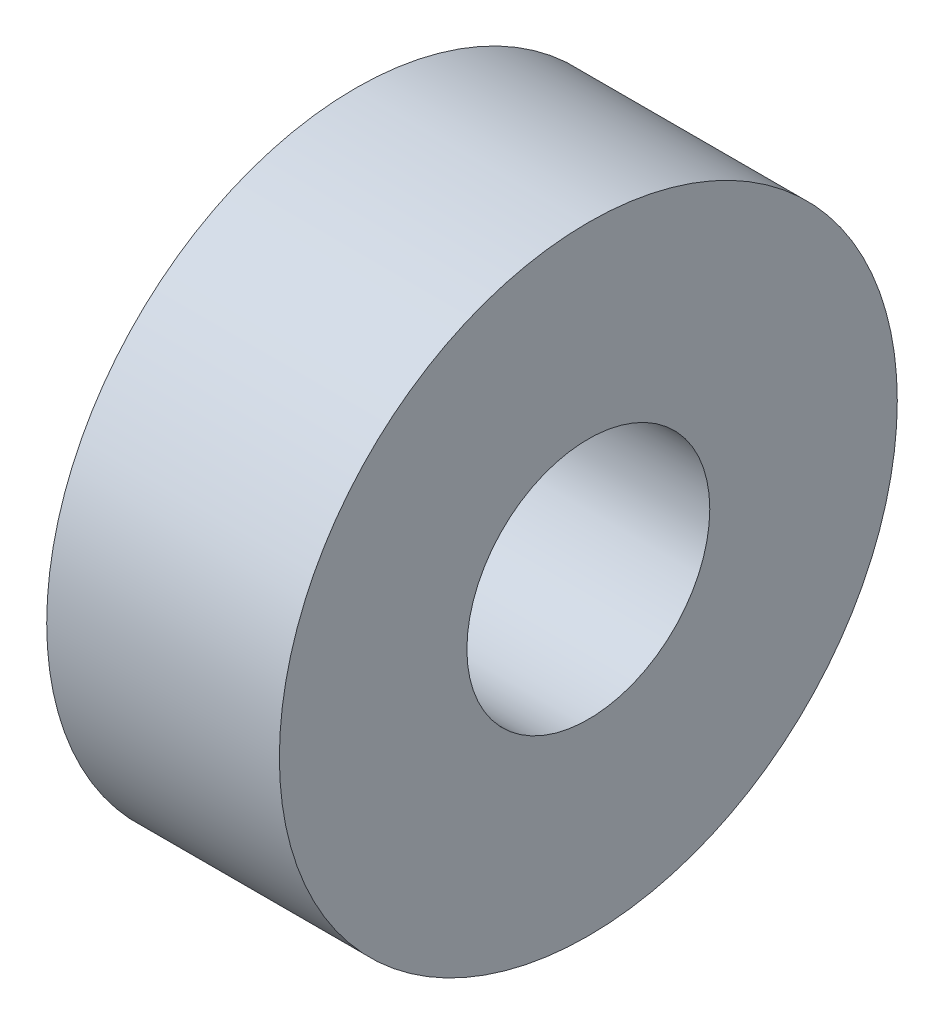
ISO-10303-21;
HEADER;
FILE_DESCRIPTION(('STEP AP214'),'2;1');
FILE_NAME('part.step','',(''),(''),'','','');
FILE_SCHEMA(('AUTOMOTIVE_DESIGN { 1 0 10303 214 1 1 1 1 }'));
ENDSEC;
DATA;
#1=APPLICATION_CONTEXT('core data for automotive mechanical design processes');
#2=APPLICATION_PROTOCOL_DEFINITION('international standard','automotive_design',2000,#1);
#3=PRODUCT_CONTEXT('',#1,'mechanical');
#4=PRODUCT('Part','Part','',(#3));
#5=PRODUCT_RELATED_PRODUCT_CATEGORY('part','',(#4));
#6=PRODUCT_DEFINITION_FORMATION('','',#4);
#7=PRODUCT_DEFINITION_CONTEXT('part definition',#1,'design');
#8=PRODUCT_DEFINITION('design','',#6,#7);
#9=PRODUCT_DEFINITION_SHAPE('','',#8);
#10=(LENGTH_UNIT() NAMED_UNIT(*) SI_UNIT(.MILLI.,.METRE.));
#11=(NAMED_UNIT(*) PLANE_ANGLE_UNIT() SI_UNIT($,.RADIAN.));
#12=(NAMED_UNIT(*) SI_UNIT($,.STERADIAN.) SOLID_ANGLE_UNIT());
#13=UNCERTAINTY_MEASURE_WITH_UNIT(LENGTH_MEASURE(1.E-05),#10,'distance_accuracy_value','');
#14=(GEOMETRIC_REPRESENTATION_CONTEXT(3) GLOBAL_UNCERTAINTY_ASSIGNED_CONTEXT((#13)) GLOBAL_UNIT_ASSIGNED_CONTEXT((#10,
#11,#12)) REPRESENTATION_CONTEXT('',''));
#15=CARTESIAN_POINT('',(0.,0.,0.));
#16=DIRECTION('',(0.,0.,1.));
#17=DIRECTION('',(1.,0.,0.));
#18=AXIS2_PLACEMENT_3D('',#15,#16,#17);
#19=CARTESIAN_POINT('',(3.04124106,0.,0.));
#20=DIRECTION('',(1.,0.,0.));
#21=DIRECTION('',(0.,0.,-1.));
#22=AXIS2_PLACEMENT_3D('',#19,#20,#21);
#23=PLANE('',#22);
#24=CARTESIAN_POINT('',(3.04124106,0.,0.));
#25=DIRECTION('',(-1.,0.,0.));
#26=DIRECTION('',(0.,0.,1.));
#27=AXIS2_PLACEMENT_3D('',#24,#25,#26);
#28=CIRCLE('',#27,4.0386);
#29=CARTESIAN_POINT('',(3.04124106,0.,4.0386));
#30=VERTEX_POINT('',#29);
#31=EDGE_CURVE('E27',#30,#30,#28,.T.);
#32=ORIENTED_EDGE('',*,*,#31,.F.);
#33=EDGE_LOOP('',(#32));
#34=FACE_BOUND('',#33,.T.);
#35=CARTESIAN_POINT('',(3.04124106,0.,0.));
#36=DIRECTION('',(-1.,0.,0.));
#37=DIRECTION('',(0.,0.,1.));
#38=AXIS2_PLACEMENT_3D('',#35,#36,#37);
#39=CIRCLE('',#38,1.5875);
#40=CARTESIAN_POINT('',(3.04124106,0.,1.5875));
#41=VERTEX_POINT('',#40);
#42=EDGE_CURVE('E18',#41,#41,#39,.T.);
#43=ORIENTED_EDGE('',*,*,#42,.T.);
#44=EDGE_LOOP('',(#43));
#45=FACE_BOUND('',#44,.T.);
#46=ADVANCED_FACE('F15',(#34,#45),#23,.T.);
#47=CARTESIAN_POINT('',(3.04124106,0.,0.));
#48=DIRECTION('',(-1.,0.,0.));
#49=DIRECTION('',(0.,0.,1.));
#50=AXIS2_PLACEMENT_3D('',#47,#48,#49);
#51=CYLINDRICAL_SURFACE('',#50,1.5875);
#52=CARTESIAN_POINT('',(0.,0.,0.));
#53=DIRECTION('',(-1.,0.,0.));
#54=DIRECTION('',(0.,0.,1.));
#55=AXIS2_PLACEMENT_3D('',#52,#53,#54);
#56=CIRCLE('',#55,1.5875);
#57=CARTESIAN_POINT('',(0.,0.,1.5875));
#58=VERTEX_POINT('',#57);
#59=EDGE_CURVE('E22',#58,#58,#56,.T.);
#60=ORIENTED_EDGE('',*,*,#59,.T.);
#61=EDGE_LOOP('',(#60));
#62=FACE_BOUND('',#61,.T.);
#63=ORIENTED_EDGE('',*,*,#42,.F.);
#64=EDGE_LOOP('',(#63));
#65=FACE_BOUND('',#64,.T.);
#66=ADVANCED_FACE('F36',(#62,#65),#51,.F.);
#67=CARTESIAN_POINT('',(3.04124106,0.,0.));
#68=DIRECTION('',(-1.,0.,0.));
#69=DIRECTION('',(0.,0.,1.));
#70=AXIS2_PLACEMENT_3D('',#67,#68,#69);
#71=CYLINDRICAL_SURFACE('',#70,4.0386);
#72=ORIENTED_EDGE('',*,*,#31,.T.);
#73=EDGE_LOOP('',(#72));
#74=FACE_BOUND('',#73,.T.);
#75=CARTESIAN_POINT('',(0.,0.,0.));
#76=DIRECTION('',(-1.,0.,0.));
#77=DIRECTION('',(0.,0.,1.));
#78=AXIS2_PLACEMENT_3D('',#75,#76,#77);
#79=CIRCLE('',#78,4.0386);
#80=CARTESIAN_POINT('',(0.,0.,4.0386));
#81=VERTEX_POINT('',#80);
#82=EDGE_CURVE('E10',#81,#81,#79,.F.);
#83=ORIENTED_EDGE('',*,*,#82,.T.);
#84=EDGE_LOOP('',(#83));
#85=FACE_BOUND('',#84,.T.);
#86=ADVANCED_FACE('F38',(#74,#85),#71,.T.);
#87=CARTESIAN_POINT('',(0.,0.,0.));
#88=DIRECTION('',(1.,0.,0.));
#89=DIRECTION('',(0.,0.,-1.));
#90=AXIS2_PLACEMENT_3D('',#87,#88,#89);
#91=PLANE('',#90);
#92=ORIENTED_EDGE('',*,*,#82,.F.);
#93=EDGE_LOOP('',(#92));
#94=FACE_BOUND('',#93,.T.);
#95=ORIENTED_EDGE('',*,*,#59,.F.);
#96=EDGE_LOOP('',(#95));
#97=FACE_BOUND('',#96,.T.);
#98=ADVANCED_FACE('F45',(#94,#97),#91,.F.);
#99=CLOSED_SHELL('',(#46,#66,#86,#98));
#100=MANIFOLD_SOLID_BREP('B1',#99);
#101=ADVANCED_BREP_SHAPE_REPRESENTATION('',(#18,#100),#14);
#102=SHAPE_DEFINITION_REPRESENTATION(#9,#101);
ENDSEC;
END-ISO-10303-21;
